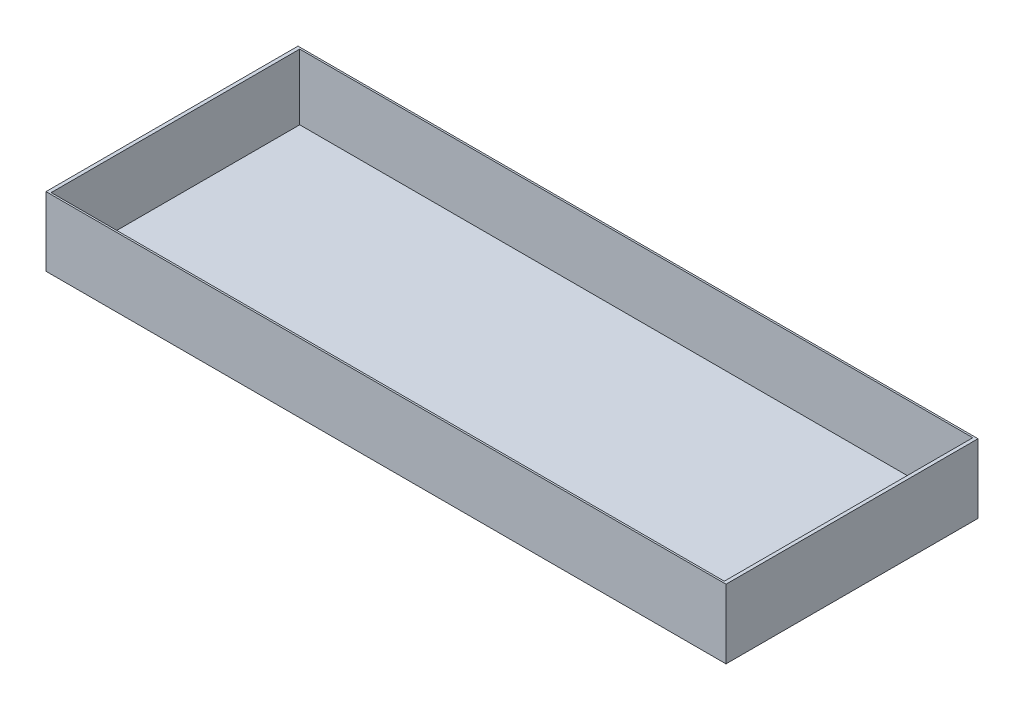
ISO-10303-21;
HEADER;
FILE_DESCRIPTION(('STEP AP214'),'2;1');
FILE_NAME('part.step','',(''),(''),'','','');
FILE_SCHEMA(('AUTOMOTIVE_DESIGN { 1 0 10303 214 1 1 1 1 }'));
ENDSEC;
DATA;
#1=APPLICATION_CONTEXT('core data for automotive mechanical design processes');
#2=APPLICATION_PROTOCOL_DEFINITION('international standard','automotive_design',2000,#1);
#3=PRODUCT_CONTEXT('',#1,'mechanical');
#4=PRODUCT('Part','Part','',(#3));
#5=PRODUCT_RELATED_PRODUCT_CATEGORY('part','',(#4));
#6=PRODUCT_DEFINITION_FORMATION('','',#4);
#7=PRODUCT_DEFINITION_CONTEXT('part definition',#1,'design');
#8=PRODUCT_DEFINITION('design','',#6,#7);
#9=PRODUCT_DEFINITION_SHAPE('','',#8);
#10=(LENGTH_UNIT() NAMED_UNIT(*) SI_UNIT(.MILLI.,.METRE.));
#11=(NAMED_UNIT(*) PLANE_ANGLE_UNIT() SI_UNIT($,.RADIAN.));
#12=(NAMED_UNIT(*) SI_UNIT($,.STERADIAN.) SOLID_ANGLE_UNIT());
#13=UNCERTAINTY_MEASURE_WITH_UNIT(LENGTH_MEASURE(1.E-05),#10,'distance_accuracy_value','');
#14=(GEOMETRIC_REPRESENTATION_CONTEXT(3) GLOBAL_UNCERTAINTY_ASSIGNED_CONTEXT((#13)) GLOBAL_UNIT_ASSIGNED_CONTEXT((#10,
#11,#12)) REPRESENTATION_CONTEXT('',''));
#15=CARTESIAN_POINT('',(0.,0.,0.));
#16=DIRECTION('',(0.,0.,1.));
#17=DIRECTION('',(1.,0.,0.));
#18=AXIS2_PLACEMENT_3D('',#15,#16,#17);
#19=CARTESIAN_POINT('',(98.5,20.,-36.5));
#20=DIRECTION('',(-1.,0.,0.));
#21=DIRECTION('',(0.,0.,1.));
#22=AXIS2_PLACEMENT_3D('',#19,#20,#21);
#23=PLANE('',#22);
#24=DIRECTION('',(0.,0.,-1.));
#25=VECTOR('',#24,1.);
#26=CARTESIAN_POINT('',(98.5,0.,-36.5));
#27=LINE('',#26,#25);
#28=CARTESIAN_POINT('',(98.5,0.,36.5));
#29=VERTEX_POINT('',#28);
#30=CARTESIAN_POINT('',(98.5,0.,-36.5));
#31=VERTEX_POINT('',#30);
#32=EDGE_CURVE('E158',#29,#31,#27,.T.);
#33=ORIENTED_EDGE('',*,*,#32,.T.);
#34=DIRECTION('',(0.,-1.,0.));
#35=VECTOR('',#34,1.);
#36=CARTESIAN_POINT('',(98.5,20.,-36.5));
#37=LINE('',#36,#35);
#38=CARTESIAN_POINT('',(98.5,20.,-36.5));
#39=VERTEX_POINT('',#38);
#40=EDGE_CURVE('E11',#39,#31,#37,.T.);
#41=ORIENTED_EDGE('',*,*,#40,.F.);
#42=DIRECTION('',(0.,0.,-1.));
#43=VECTOR('',#42,1.);
#44=CARTESIAN_POINT('',(98.5,20.,-36.5));
#45=LINE('',#44,#43);
#46=CARTESIAN_POINT('',(98.5,20.,36.5));
#47=VERTEX_POINT('',#46);
#48=EDGE_CURVE('E164',#47,#39,#45,.T.);
#49=ORIENTED_EDGE('',*,*,#48,.F.);
#50=DIRECTION('',(0.,-1.,0.));
#51=VECTOR('',#50,1.);
#52=CARTESIAN_POINT('',(98.5,20.,36.5));
#53=LINE('',#52,#51);
#54=EDGE_CURVE('E174',#47,#29,#53,.T.);
#55=ORIENTED_EDGE('',*,*,#54,.T.);
#56=EDGE_LOOP('',(#33,#41,#49,#55));
#57=FACE_BOUND('',#56,.T.);
#58=ADVANCED_FACE('F39',(#57),#23,.F.);
#59=CARTESIAN_POINT('',(-98.5,20.,-36.5));
#60=DIRECTION('',(0.,0.,1.));
#61=DIRECTION('',(1.,0.,0.));
#62=AXIS2_PLACEMENT_3D('',#59,#60,#61);
#63=PLANE('',#62);
#64=DIRECTION('',(-1.,0.,0.));
#65=VECTOR('',#64,1.);
#66=CARTESIAN_POINT('',(-98.5,0.,-36.5));
#67=LINE('',#66,#65);
#68=CARTESIAN_POINT('',(-98.5,0.,-36.5));
#69=VERTEX_POINT('',#68);
#70=EDGE_CURVE('E178',#31,#69,#67,.T.);
#71=ORIENTED_EDGE('',*,*,#70,.T.);
#72=DIRECTION('',(0.,-1.,0.));
#73=VECTOR('',#72,1.);
#74=CARTESIAN_POINT('',(-98.5,20.,-36.5));
#75=LINE('',#74,#73);
#76=CARTESIAN_POINT('',(-98.5,20.,-36.5));
#77=VERTEX_POINT('',#76);
#78=EDGE_CURVE('E47',#77,#69,#75,.T.);
#79=ORIENTED_EDGE('',*,*,#78,.F.);
#80=DIRECTION('',(-1.,0.,0.));
#81=VECTOR('',#80,1.);
#82=CARTESIAN_POINT('',(-98.5,20.,-36.5));
#83=LINE('',#82,#81);
#84=EDGE_CURVE('E91',#39,#77,#83,.T.);
#85=ORIENTED_EDGE('',*,*,#84,.F.);
#86=ORIENTED_EDGE('',*,*,#40,.T.);
#87=EDGE_LOOP('',(#71,#79,#85,#86));
#88=FACE_BOUND('',#87,.T.);
#89=ADVANCED_FACE('F213',(#88),#63,.F.);
#90=CARTESIAN_POINT('',(-98.5,20.,-36.5));
#91=DIRECTION('',(1.,0.,0.));
#92=DIRECTION('',(0.,0.,-1.));
#93=AXIS2_PLACEMENT_3D('',#90,#91,#92);
#94=PLANE('',#93);
#95=DIRECTION('',(0.,0.,1.));
#96=VECTOR('',#95,1.);
#97=CARTESIAN_POINT('',(-98.5,0.,-36.5));
#98=LINE('',#97,#96);
#99=CARTESIAN_POINT('',(-98.5,0.,36.5));
#100=VERTEX_POINT('',#99);
#101=EDGE_CURVE('E181',#69,#100,#98,.T.);
#102=ORIENTED_EDGE('',*,*,#101,.T.);
#103=DIRECTION('',(0.,-1.,0.));
#104=VECTOR('',#103,1.);
#105=CARTESIAN_POINT('',(-98.5,20.,36.5));
#106=LINE('',#105,#104);
#107=CARTESIAN_POINT('',(-98.5,20.,36.5));
#108=VERTEX_POINT('',#107);
#109=EDGE_CURVE('E188',#108,#100,#106,.T.);
#110=ORIENTED_EDGE('',*,*,#109,.F.);
#111=DIRECTION('',(0.,0.,1.));
#112=VECTOR('',#111,1.);
#113=CARTESIAN_POINT('',(-98.5,20.,-36.5));
#114=LINE('',#113,#112);
#115=EDGE_CURVE('E169',#77,#108,#114,.T.);
#116=ORIENTED_EDGE('',*,*,#115,.F.);
#117=ORIENTED_EDGE('',*,*,#78,.T.);
#118=EDGE_LOOP('',(#102,#110,#116,#117));
#119=FACE_BOUND('',#118,.T.);
#120=ADVANCED_FACE('F195',(#119),#94,.F.);
#121=CARTESIAN_POINT('',(-98.5,20.,36.5));
#122=DIRECTION('',(0.,0.,-1.));
#123=DIRECTION('',(-1.,0.,0.));
#124=AXIS2_PLACEMENT_3D('',#121,#122,#123);
#125=PLANE('',#124);
#126=DIRECTION('',(1.,0.,0.));
#127=VECTOR('',#126,1.);
#128=CARTESIAN_POINT('',(-98.5,0.,36.5));
#129=LINE('',#128,#127);
#130=EDGE_CURVE('E84',#100,#29,#129,.T.);
#131=ORIENTED_EDGE('',*,*,#130,.T.);
#132=ORIENTED_EDGE('',*,*,#54,.F.);
#133=DIRECTION('',(1.,0.,0.));
#134=VECTOR('',#133,1.);
#135=CARTESIAN_POINT('',(-98.5,20.,36.5));
#136=LINE('',#135,#134);
#137=EDGE_CURVE('E63',#108,#47,#136,.T.);
#138=ORIENTED_EDGE('',*,*,#137,.F.);
#139=ORIENTED_EDGE('',*,*,#109,.T.);
#140=EDGE_LOOP('',(#131,#132,#138,#139));
#141=FACE_BOUND('',#140,.T.);
#142=ADVANCED_FACE('F203',(#141),#125,.F.);
#143=CARTESIAN_POINT('',(0.,20.,0.));
#144=DIRECTION('',(0.,1.,0.));
#145=DIRECTION('',(0.,0.,1.));
#146=AXIS2_PLACEMENT_3D('',#143,#144,#145);
#147=PLANE('',#146);
#148=DIRECTION('',(0.,0.,-1.));
#149=VECTOR('',#148,1.);
#150=CARTESIAN_POINT('',(97.5,20.,-36.));
#151=LINE('',#150,#149);
#152=CARTESIAN_POINT('',(97.5,20.,36.));
#153=VERTEX_POINT('',#152);
#154=CARTESIAN_POINT('',(97.5,20.,-36.));
#155=VERTEX_POINT('',#154);
#156=EDGE_CURVE('E54',#153,#155,#151,.T.);
#157=ORIENTED_EDGE('',*,*,#156,.F.);
#158=DIRECTION('',(1.,0.,0.));
#159=VECTOR('',#158,1.);
#160=CARTESIAN_POINT('',(-97.5,20.,36.));
#161=LINE('',#160,#159);
#162=CARTESIAN_POINT('',(-97.5,20.,36.));
#163=VERTEX_POINT('',#162);
#164=EDGE_CURVE('E136',#163,#153,#161,.T.);
#165=ORIENTED_EDGE('',*,*,#164,.F.);
#166=DIRECTION('',(0.,0.,1.));
#167=VECTOR('',#166,1.);
#168=CARTESIAN_POINT('',(-97.5,20.,-36.));
#169=LINE('',#168,#167);
#170=CARTESIAN_POINT('',(-97.5,20.,-36.));
#171=VERTEX_POINT('',#170);
#172=EDGE_CURVE('E140',#171,#163,#169,.T.);
#173=ORIENTED_EDGE('',*,*,#172,.F.);
#174=DIRECTION('',(-1.,0.,0.));
#175=VECTOR('',#174,1.);
#176=CARTESIAN_POINT('',(-97.5,20.,-36.));
#177=LINE('',#176,#175);
#178=EDGE_CURVE('E149',#155,#171,#177,.T.);
#179=ORIENTED_EDGE('',*,*,#178,.F.);
#180=EDGE_LOOP('',(#157,#165,#173,#179));
#181=FACE_BOUND('',#180,.T.);
#182=ORIENTED_EDGE('',*,*,#48,.T.);
#183=ORIENTED_EDGE('',*,*,#84,.T.);
#184=ORIENTED_EDGE('',*,*,#115,.T.);
#185=ORIENTED_EDGE('',*,*,#137,.T.);
#186=EDGE_LOOP('',(#182,#183,#184,#185));
#187=FACE_BOUND('',#186,.T.);
#188=ADVANCED_FACE('F205',(#181,#187),#147,.T.);
#189=CARTESIAN_POINT('',(0.,0.,0.));
#190=DIRECTION('',(0.,1.,0.));
#191=DIRECTION('',(0.,0.,1.));
#192=AXIS2_PLACEMENT_3D('',#189,#190,#191);
#193=PLANE('',#192);
#194=ORIENTED_EDGE('',*,*,#32,.F.);
#195=ORIENTED_EDGE('',*,*,#130,.F.);
#196=ORIENTED_EDGE('',*,*,#101,.F.);
#197=ORIENTED_EDGE('',*,*,#70,.F.);
#198=EDGE_LOOP('',(#194,#195,#196,#197));
#199=FACE_BOUND('',#198,.T.);
#200=ADVANCED_FACE('F199',(#199),#193,.F.);
#201=CARTESIAN_POINT('',(97.5,1.,-36.));
#202=DIRECTION('',(1.,0.,0.));
#203=DIRECTION('',(0.,0.,-1.));
#204=AXIS2_PLACEMENT_3D('',#201,#202,#203);
#205=PLANE('',#204);
#206=ORIENTED_EDGE('',*,*,#156,.T.);
#207=DIRECTION('',(0.,1.,0.));
#208=VECTOR('',#207,1.);
#209=CARTESIAN_POINT('',(97.5,1.,-36.));
#210=LINE('',#209,#208);
#211=CARTESIAN_POINT('',(97.5,1.,-36.));
#212=VERTEX_POINT('',#211);
#213=EDGE_CURVE('E111',#212,#155,#210,.T.);
#214=ORIENTED_EDGE('',*,*,#213,.F.);
#215=DIRECTION('',(0.,0.,-1.));
#216=VECTOR('',#215,1.);
#217=CARTESIAN_POINT('',(97.5,1.,-36.));
#218=LINE('',#217,#216);
#219=CARTESIAN_POINT('',(97.5,1.,36.));
#220=VERTEX_POINT('',#219);
#221=EDGE_CURVE('E115',#220,#212,#218,.T.);
#222=ORIENTED_EDGE('',*,*,#221,.F.);
#223=DIRECTION('',(0.,1.,0.));
#224=VECTOR('',#223,1.);
#225=CARTESIAN_POINT('',(97.5,1.,36.));
#226=LINE('',#225,#224);
#227=EDGE_CURVE('E155',#220,#153,#226,.T.);
#228=ORIENTED_EDGE('',*,*,#227,.T.);
#229=EDGE_LOOP('',(#206,#214,#222,#228));
#230=FACE_BOUND('',#229,.T.);
#231=ADVANCED_FACE('F113',(#230),#205,.F.);
#232=CARTESIAN_POINT('',(-97.5,1.,36.));
#233=DIRECTION('',(0.,0.,1.));
#234=DIRECTION('',(1.,0.,0.));
#235=AXIS2_PLACEMENT_3D('',#232,#233,#234);
#236=PLANE('',#235);
#237=ORIENTED_EDGE('',*,*,#164,.T.);
#238=ORIENTED_EDGE('',*,*,#227,.F.);
#239=DIRECTION('',(1.,0.,0.));
#240=VECTOR('',#239,1.);
#241=CARTESIAN_POINT('',(-97.5,1.,36.));
#242=LINE('',#241,#240);
#243=CARTESIAN_POINT('',(-97.5,1.,36.));
#244=VERTEX_POINT('',#243);
#245=EDGE_CURVE('E122',#244,#220,#242,.T.);
#246=ORIENTED_EDGE('',*,*,#245,.F.);
#247=DIRECTION('',(0.,1.,0.));
#248=VECTOR('',#247,1.);
#249=CARTESIAN_POINT('',(-97.5,1.,36.));
#250=LINE('',#249,#248);
#251=EDGE_CURVE('E159',#244,#163,#250,.T.);
#252=ORIENTED_EDGE('',*,*,#251,.T.);
#253=EDGE_LOOP('',(#237,#238,#246,#252));
#254=FACE_BOUND('',#253,.T.);
#255=ADVANCED_FACE('F252',(#254),#236,.F.);
#256=CARTESIAN_POINT('',(-97.5,1.,-36.));
#257=DIRECTION('',(-1.,0.,0.));
#258=DIRECTION('',(0.,0.,1.));
#259=AXIS2_PLACEMENT_3D('',#256,#257,#258);
#260=PLANE('',#259);
#261=ORIENTED_EDGE('',*,*,#172,.T.);
#262=ORIENTED_EDGE('',*,*,#251,.F.);
#263=DIRECTION('',(0.,0.,1.));
#264=VECTOR('',#263,1.);
#265=CARTESIAN_POINT('',(-97.5,1.,-36.));
#266=LINE('',#265,#264);
#267=CARTESIAN_POINT('',(-97.5,1.,-36.));
#268=VERTEX_POINT('',#267);
#269=EDGE_CURVE('E131',#268,#244,#266,.T.);
#270=ORIENTED_EDGE('',*,*,#269,.F.);
#271=DIRECTION('',(0.,1.,0.));
#272=VECTOR('',#271,1.);
#273=CARTESIAN_POINT('',(-97.5,1.,-36.));
#274=LINE('',#273,#272);
#275=EDGE_CURVE('E121',#268,#171,#274,.T.);
#276=ORIENTED_EDGE('',*,*,#275,.T.);
#277=EDGE_LOOP('',(#261,#262,#270,#276));
#278=FACE_BOUND('',#277,.T.);
#279=ADVANCED_FACE('F261',(#278),#260,.F.);
#280=CARTESIAN_POINT('',(-97.5,1.,-36.));
#281=DIRECTION('',(0.,0.,-1.));
#282=DIRECTION('',(-1.,0.,0.));
#283=AXIS2_PLACEMENT_3D('',#280,#281,#282);
#284=PLANE('',#283);
#285=ORIENTED_EDGE('',*,*,#178,.T.);
#286=ORIENTED_EDGE('',*,*,#275,.F.);
#287=DIRECTION('',(-1.,0.,0.));
#288=VECTOR('',#287,1.);
#289=CARTESIAN_POINT('',(-97.5,1.,-36.));
#290=LINE('',#289,#288);
#291=EDGE_CURVE('E125',#212,#268,#290,.T.);
#292=ORIENTED_EDGE('',*,*,#291,.F.);
#293=ORIENTED_EDGE('',*,*,#213,.T.);
#294=EDGE_LOOP('',(#285,#286,#292,#293));
#295=FACE_BOUND('',#294,.T.);
#296=ADVANCED_FACE('F126',(#295),#284,.F.);
#297=CARTESIAN_POINT('',(0.,1.,0.));
#298=DIRECTION('',(0.,1.,0.));
#299=DIRECTION('',(0.,0.,1.));
#300=AXIS2_PLACEMENT_3D('',#297,#298,#299);
#301=PLANE('',#300);
#302=ORIENTED_EDGE('',*,*,#221,.T.);
#303=ORIENTED_EDGE('',*,*,#291,.T.);
#304=ORIENTED_EDGE('',*,*,#269,.T.);
#305=ORIENTED_EDGE('',*,*,#245,.T.);
#306=EDGE_LOOP('',(#302,#303,#304,#305));
#307=FACE_BOUND('',#306,.T.);
#308=ADVANCED_FACE('F133',(#307),#301,.T.);
#309=CLOSED_SHELL('',(#58,#89,#120,#142,#188,#200,#231,#255,#279,#296,#308));
#310=MANIFOLD_SOLID_BREP('B2',#309);
#311=ADVANCED_BREP_SHAPE_REPRESENTATION('',(#18,#310),#14);
#312=SHAPE_DEFINITION_REPRESENTATION(#9,#311);
ENDSEC;
END-ISO-10303-21;
